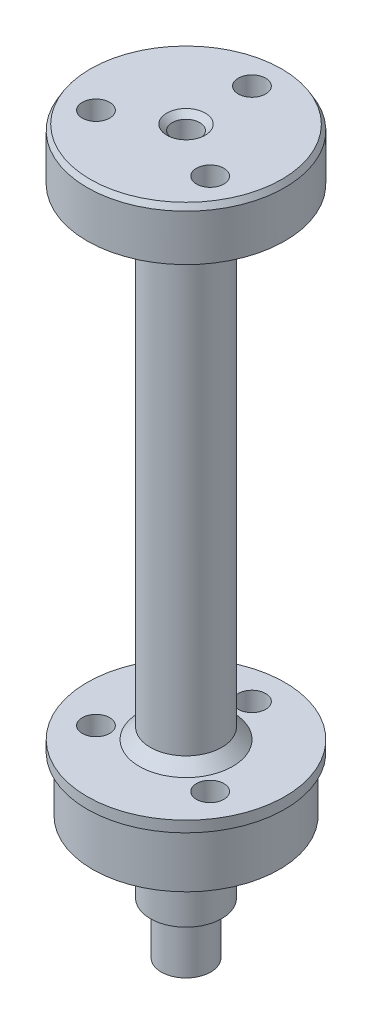
ISO-10303-21;
HEADER;
FILE_DESCRIPTION(('STEP AP214'),'2;1');
FILE_NAME('part.step','',(''),(''),'','','');
FILE_SCHEMA(('AUTOMOTIVE_DESIGN { 1 0 10303 214 1 1 1 1 }'));
ENDSEC;
DATA;
#1=APPLICATION_CONTEXT('core data for automotive mechanical design processes');
#2=APPLICATION_PROTOCOL_DEFINITION('international standard','automotive_design',2000,#1);
#3=PRODUCT_CONTEXT('',#1,'mechanical');
#4=PRODUCT('Part','Part','',(#3));
#5=PRODUCT_RELATED_PRODUCT_CATEGORY('part','',(#4));
#6=PRODUCT_DEFINITION_FORMATION('','',#4);
#7=PRODUCT_DEFINITION_CONTEXT('part definition',#1,'design');
#8=PRODUCT_DEFINITION('design','',#6,#7);
#9=PRODUCT_DEFINITION_SHAPE('','',#8);
#10=(LENGTH_UNIT() NAMED_UNIT(*) SI_UNIT(.MILLI.,.METRE.));
#11=(NAMED_UNIT(*) PLANE_ANGLE_UNIT() SI_UNIT($,.RADIAN.));
#12=(NAMED_UNIT(*) SI_UNIT($,.STERADIAN.) SOLID_ANGLE_UNIT());
#13=UNCERTAINTY_MEASURE_WITH_UNIT(LENGTH_MEASURE(1.E-05),#10,'distance_accuracy_value','');
#14=(GEOMETRIC_REPRESENTATION_CONTEXT(3) GLOBAL_UNCERTAINTY_ASSIGNED_CONTEXT((#13)) GLOBAL_UNIT_ASSIGNED_CONTEXT((#10,
#11,#12)) REPRESENTATION_CONTEXT('',''));
#15=CARTESIAN_POINT('',(0.,0.,0.));
#16=DIRECTION('',(0.,0.,1.));
#17=DIRECTION('',(1.,0.,0.));
#18=AXIS2_PLACEMENT_3D('',#15,#16,#17);
#19=CARTESIAN_POINT('',(9.00000000000001,54.5,0.));
#20=DIRECTION('',(0.,-1.,0.));
#21=DIRECTION('',(0.,0.,-1.));
#22=AXIS2_PLACEMENT_3D('',#19,#20,#21);
#23=PLANE('',#22);
#24=CARTESIAN_POINT('',(-5.19615242270664,54.5,3.));
#25=DIRECTION('',(0.,1.,0.));
#26=DIRECTION('',(0.,0.,1.));
#27=AXIS2_PLACEMENT_3D('',#24,#25,#26);
#28=CIRCLE('',#27,1.24999999999999);
#29=CARTESIAN_POINT('',(-5.19615242270664,54.5,4.24999999999999));
#30=VERTEX_POINT('',#29);
#31=EDGE_CURVE('E94',#30,#30,#28,.T.);
#32=ORIENTED_EDGE('',*,*,#31,.F.);
#33=EDGE_LOOP('',(#32));
#34=FACE_BOUND('',#33,.T.);
#35=CARTESIAN_POINT('',(5.19615242270664,54.5,3.));
#36=DIRECTION('',(0.,1.,0.));
#37=DIRECTION('',(0.,0.,1.));
#38=AXIS2_PLACEMENT_3D('',#35,#36,#37);
#39=CIRCLE('',#38,1.24999999999999);
#40=CARTESIAN_POINT('',(5.19615242270664,54.5,4.24999999999999));
#41=VERTEX_POINT('',#40);
#42=EDGE_CURVE('E89',#41,#41,#39,.T.);
#43=ORIENTED_EDGE('',*,*,#42,.F.);
#44=EDGE_LOOP('',(#43));
#45=FACE_BOUND('',#44,.T.);
#46=CARTESIAN_POINT('',(0.,54.5,-6.00000000000001));
#47=DIRECTION('',(0.,1.,0.));
#48=DIRECTION('',(0.,0.,1.));
#49=AXIS2_PLACEMENT_3D('',#46,#47,#48);
#50=CIRCLE('',#49,1.24999999999999);
#51=CARTESIAN_POINT('',(0.,54.5,-4.75000000000003));
#52=VERTEX_POINT('',#51);
#53=EDGE_CURVE('E84',#52,#52,#50,.T.);
#54=ORIENTED_EDGE('',*,*,#53,.F.);
#55=EDGE_LOOP('',(#54));
#56=FACE_BOUND('',#55,.T.);
#57=CARTESIAN_POINT('',(0.,54.5,0.));
#58=DIRECTION('',(0.,-1.,0.));
#59=DIRECTION('',(0.,0.,-1.));
#60=AXIS2_PLACEMENT_3D('',#57,#58,#59);
#61=CIRCLE('',#60,8.71132486540521);
#62=CARTESIAN_POINT('',(0.,54.5,-8.71132486540521));
#63=VERTEX_POINT('',#62);
#64=EDGE_CURVE('E10',#63,#63,#61,.F.);
#65=ORIENTED_EDGE('',*,*,#64,.T.);
#66=EDGE_LOOP('',(#65));
#67=FACE_BOUND('',#66,.T.);
#68=CARTESIAN_POINT('',(0.,54.5,0.));
#69=DIRECTION('',(0.,1.,0.));
#70=DIRECTION('',(0.,0.,1.));
#71=AXIS2_PLACEMENT_3D('',#68,#69,#70);
#72=CIRCLE('',#71,1.75);
#73=CARTESIAN_POINT('',(0.,54.5,1.75));
#74=VERTEX_POINT('',#73);
#75=EDGE_CURVE('E142',#74,#74,#72,.T.);
#76=ORIENTED_EDGE('',*,*,#75,.F.);
#77=EDGE_LOOP('',(#76));
#78=FACE_BOUND('',#77,.T.);
#79=ADVANCED_FACE('F40',(#34,#45,#56,#67,#78),#23,.F.);
#80=CARTESIAN_POINT('',(0.,60.,0.));
#81=DIRECTION('',(0.,1.,0.));
#82=DIRECTION('',(0.,0.,1.));
#83=AXIS2_PLACEMENT_3D('',#80,#81,#82);
#84=CYLINDRICAL_SURFACE('',#83,3.25);
#85=CARTESIAN_POINT('',(0.,0.,0.));
#86=DIRECTION('',(0.,1.,0.));
#87=DIRECTION('',(0.,0.,1.));
#88=AXIS2_PLACEMENT_3D('',#85,#86,#87);
#89=CIRCLE('',#88,3.25);
#90=CARTESIAN_POINT('',(0.,0.,3.25));
#91=VERTEX_POINT('',#90);
#92=EDGE_CURVE('E115',#91,#91,#89,.T.);
#93=ORIENTED_EDGE('',*,*,#92,.F.);
#94=EDGE_LOOP('',(#93));
#95=FACE_BOUND('',#94,.T.);
#96=CARTESIAN_POINT('',(0.,-6.50000000000001,0.));
#97=DIRECTION('',(0.,1.,0.));
#98=DIRECTION('',(0.,0.,1.));
#99=AXIS2_PLACEMENT_3D('',#96,#97,#98);
#100=CIRCLE('',#99,3.25);
#101=CARTESIAN_POINT('',(0.,-6.50000000000001,3.25));
#102=VERTEX_POINT('',#101);
#103=EDGE_CURVE('E79',#102,#102,#100,.T.);
#104=ORIENTED_EDGE('',*,*,#103,.T.);
#105=EDGE_LOOP('',(#104));
#106=FACE_BOUND('',#105,.T.);
#107=ADVANCED_FACE('F149',(#95,#106),#84,.T.);
#108=CARTESIAN_POINT('',(3.25,-6.5,0.));
#109=DIRECTION('',(0.,1.,0.));
#110=DIRECTION('',(0.,0.,1.));
#111=AXIS2_PLACEMENT_3D('',#108,#109,#110);
#112=PLANE('',#111);
#113=ORIENTED_EDGE('',*,*,#103,.F.);
#114=EDGE_LOOP('',(#113));
#115=FACE_BOUND('',#114,.T.);
#116=CARTESIAN_POINT('',(0.,-6.50000000000001,0.));
#117=DIRECTION('',(0.,1.,0.));
#118=DIRECTION('',(0.,0.,1.));
#119=AXIS2_PLACEMENT_3D('',#116,#117,#118);
#120=CIRCLE('',#119,2.25000000000001);
#121=CARTESIAN_POINT('',(0.,-6.50000000000001,2.25000000000001));
#122=VERTEX_POINT('',#121);
#123=EDGE_CURVE('E97',#122,#122,#120,.T.);
#124=ORIENTED_EDGE('',*,*,#123,.T.);
#125=EDGE_LOOP('',(#124));
#126=FACE_BOUND('',#125,.T.);
#127=ADVANCED_FACE('F155',(#115,#126),#112,.F.);
#128=CARTESIAN_POINT('',(0.,60.,0.));
#129=DIRECTION('',(0.,1.,0.));
#130=DIRECTION('',(0.,0.,1.));
#131=AXIS2_PLACEMENT_3D('',#128,#129,#130);
#132=CYLINDRICAL_SURFACE('',#131,2.25000000000001);
#133=CARTESIAN_POINT('',(0.,-11.2113248654052,0.));
#134=DIRECTION('',(0.,1.,0.));
#135=DIRECTION('',(0.,0.,1.));
#136=AXIS2_PLACEMENT_3D('',#133,#134,#135);
#137=CIRCLE('',#136,2.25000000000001);
#138=CARTESIAN_POINT('',(0.,-11.2113248654052,2.25000000000001));
#139=VERTEX_POINT('',#138);
#140=EDGE_CURVE('E64',#139,#139,#137,.T.);
#141=ORIENTED_EDGE('',*,*,#140,.T.);
#142=EDGE_LOOP('',(#141));
#143=FACE_BOUND('',#142,.T.);
#144=ORIENTED_EDGE('',*,*,#123,.F.);
#145=EDGE_LOOP('',(#144));
#146=FACE_BOUND('',#145,.T.);
#147=ADVANCED_FACE('F171',(#143,#146),#132,.T.);
#148=CARTESIAN_POINT('',(2.25000000000001,-11.5,0.));
#149=DIRECTION('',(0.,1.,0.));
#150=DIRECTION('',(0.,0.,1.));
#151=AXIS2_PLACEMENT_3D('',#148,#149,#150);
#152=PLANE('',#151);
#153=CARTESIAN_POINT('',(0.,-11.5,0.));
#154=DIRECTION('',(0.,1.,0.));
#155=DIRECTION('',(0.,0.,1.));
#156=AXIS2_PLACEMENT_3D('',#153,#154,#155);
#157=CIRCLE('',#156,1.74999999999999);
#158=CARTESIAN_POINT('',(0.,-11.5,1.74999999999999));
#159=VERTEX_POINT('',#158);
#160=EDGE_CURVE('E61',#159,#159,#157,.F.);
#161=ORIENTED_EDGE('',*,*,#160,.T.);
#162=EDGE_LOOP('',(#161));
#163=FACE_BOUND('',#162,.T.);
#164=CARTESIAN_POINT('',(0.,-11.5,0.));
#165=DIRECTION('',(0.,1.,0.));
#166=DIRECTION('',(0.,0.,1.));
#167=AXIS2_PLACEMENT_3D('',#164,#165,#166);
#168=CIRCLE('',#167,1.25000000000001);
#169=CARTESIAN_POINT('',(0.,-11.5,1.25000000000001));
#170=VERTEX_POINT('',#169);
#171=EDGE_CURVE('E100',#170,#170,#168,.T.);
#172=ORIENTED_EDGE('',*,*,#171,.T.);
#173=EDGE_LOOP('',(#172));
#174=FACE_BOUND('',#173,.T.);
#175=ADVANCED_FACE('F167',(#163,#174),#152,.F.);
#176=CARTESIAN_POINT('',(0.,60.,0.));
#177=DIRECTION('',(0.,1.,0.));
#178=DIRECTION('',(0.,0.,1.));
#179=AXIS2_PLACEMENT_3D('',#176,#177,#178);
#180=CYLINDRICAL_SURFACE('',#179,1.25000000000001);
#181=ORIENTED_EDGE('',*,*,#171,.F.);
#182=EDGE_LOOP('',(#181));
#183=FACE_BOUND('',#182,.T.);
#184=CARTESIAN_POINT('',(0.,54.,0.));
#185=DIRECTION('',(0.,1.,0.));
#186=DIRECTION('',(0.,0.,1.));
#187=AXIS2_PLACEMENT_3D('',#184,#185,#186);
#188=CIRCLE('',#187,1.25);
#189=CARTESIAN_POINT('',(0.,54.,1.25));
#190=VERTEX_POINT('',#189);
#191=EDGE_CURVE('E139',#190,#190,#188,.T.);
#192=ORIENTED_EDGE('',*,*,#191,.T.);
#193=EDGE_LOOP('',(#192));
#194=FACE_BOUND('',#193,.T.);
#195=ADVANCED_FACE('F164',(#183,#194),#180,.F.);
#196=CARTESIAN_POINT('',(0.,60.,0.));
#197=DIRECTION('',(0.,1.,0.));
#198=DIRECTION('',(0.,0.,1.));
#199=AXIS2_PLACEMENT_3D('',#196,#197,#198);
#200=CYLINDRICAL_SURFACE('',#199,9.00000000000001);
#201=CARTESIAN_POINT('',(0.,49.7886751345948,0.));
#202=DIRECTION('',(0.,1.,0.));
#203=DIRECTION('',(0.,0.,1.));
#204=AXIS2_PLACEMENT_3D('',#201,#202,#203);
#205=CIRCLE('',#204,9.00000000000001);
#206=CARTESIAN_POINT('',(0.,49.7886751345948,9.00000000000001));
#207=VERTEX_POINT('',#206);
#208=EDGE_CURVE('E52',#207,#207,#205,.T.);
#209=ORIENTED_EDGE('',*,*,#208,.T.);
#210=EDGE_LOOP('',(#209));
#211=FACE_BOUND('',#210,.T.);
#212=CARTESIAN_POINT('',(0.,54.,0.));
#213=DIRECTION('',(0.,-1.,0.));
#214=DIRECTION('',(0.,0.,-1.));
#215=AXIS2_PLACEMENT_3D('',#212,#213,#214);
#216=CIRCLE('',#215,9.00000000000001);
#217=CARTESIAN_POINT('',(0.,54.,-9.00000000000001));
#218=VERTEX_POINT('',#217);
#219=EDGE_CURVE('E56',#218,#218,#216,.T.);
#220=ORIENTED_EDGE('',*,*,#219,.T.);
#221=EDGE_LOOP('',(#220));
#222=FACE_BOUND('',#221,.T.);
#223=ADVANCED_FACE('F162',(#211,#222),#200,.T.);
#224=CARTESIAN_POINT('',(9.00000000000001,49.5,0.));
#225=DIRECTION('',(0.,1.,0.));
#226=DIRECTION('',(0.,0.,1.));
#227=AXIS2_PLACEMENT_3D('',#224,#225,#226);
#228=PLANE('',#227);
#229=CARTESIAN_POINT('',(0.,49.5,0.));
#230=DIRECTION('',(0.,1.,0.));
#231=DIRECTION('',(0.,0.,1.));
#232=AXIS2_PLACEMENT_3D('',#229,#230,#231);
#233=CIRCLE('',#232,8.50000000000003);
#234=CARTESIAN_POINT('',(0.,49.5,8.50000000000003));
#235=VERTEX_POINT('',#234);
#236=EDGE_CURVE('E48',#235,#235,#233,.F.);
#237=ORIENTED_EDGE('',*,*,#236,.T.);
#238=EDGE_LOOP('',(#237));
#239=FACE_BOUND('',#238,.T.);
#240=CARTESIAN_POINT('',(0.,49.5,0.));
#241=DIRECTION('',(0.,1.,0.));
#242=DIRECTION('',(0.,0.,1.));
#243=AXIS2_PLACEMENT_3D('',#240,#241,#242);
#244=CIRCLE('',#243,4.25);
#245=CARTESIAN_POINT('',(0.,49.5,4.25));
#246=VERTEX_POINT('',#245);
#247=EDGE_CURVE('E67',#246,#246,#244,.T.);
#248=ORIENTED_EDGE('',*,*,#247,.T.);
#249=EDGE_LOOP('',(#248));
#250=FACE_BOUND('',#249,.T.);
#251=CARTESIAN_POINT('',(0.,49.5,-6.00000000000001));
#252=DIRECTION('',(0.,1.,0.));
#253=DIRECTION('',(0.,0.,1.));
#254=AXIS2_PLACEMENT_3D('',#251,#252,#253);
#255=CIRCLE('',#254,1.24999999999999);
#256=CARTESIAN_POINT('',(0.,49.5,-4.75000000000003));
#257=VERTEX_POINT('',#256);
#258=EDGE_CURVE('E132',#257,#257,#255,.T.);
#259=ORIENTED_EDGE('',*,*,#258,.T.);
#260=EDGE_LOOP('',(#259));
#261=FACE_BOUND('',#260,.T.);
#262=CARTESIAN_POINT('',(5.19615242270664,49.5,3.));
#263=DIRECTION('',(0.,1.,0.));
#264=DIRECTION('',(0.,0.,1.));
#265=AXIS2_PLACEMENT_3D('',#262,#263,#264);
#266=CIRCLE('',#265,1.24999999999999);
#267=CARTESIAN_POINT('',(5.19615242270664,49.5,4.24999999999999));
#268=VERTEX_POINT('',#267);
#269=EDGE_CURVE('E125',#268,#268,#266,.T.);
#270=ORIENTED_EDGE('',*,*,#269,.T.);
#271=EDGE_LOOP('',(#270));
#272=FACE_BOUND('',#271,.T.);
#273=CARTESIAN_POINT('',(-5.19615242270664,49.5,3.));
#274=DIRECTION('',(0.,1.,0.));
#275=DIRECTION('',(0.,0.,1.));
#276=AXIS2_PLACEMENT_3D('',#273,#274,#275);
#277=CIRCLE('',#276,1.24999999999999);
#278=CARTESIAN_POINT('',(-5.19615242270664,49.5,4.24999999999999));
#279=VERTEX_POINT('',#278);
#280=EDGE_CURVE('E118',#279,#279,#277,.T.);
#281=ORIENTED_EDGE('',*,*,#280,.T.);
#282=EDGE_LOOP('',(#281));
#283=FACE_BOUND('',#282,.T.);
#284=ADVANCED_FACE('F209',(#239,#250,#261,#272,#283),#228,.F.);
#285=CARTESIAN_POINT('',(0.,60.,0.));
#286=DIRECTION('',(0.,1.,0.));
#287=DIRECTION('',(0.,0.,1.));
#288=AXIS2_PLACEMENT_3D('',#285,#286,#287);
#289=CYLINDRICAL_SURFACE('',#288,3.24999999999999);
#290=CARTESIAN_POINT('',(0.,7.00000000000001,0.));
#291=DIRECTION('',(0.,-1.,0.));
#292=DIRECTION('',(0.,0.,-1.));
#293=AXIS2_PLACEMENT_3D('',#290,#291,#292);
#294=CIRCLE('',#293,3.24999999999999);
#295=CARTESIAN_POINT('',(0.,7.00000000000001,-3.24999999999999));
#296=VERTEX_POINT('',#295);
#297=EDGE_CURVE('E73',#296,#296,#294,.F.);
#298=ORIENTED_EDGE('',*,*,#297,.T.);
#299=EDGE_LOOP('',(#298));
#300=FACE_BOUND('',#299,.T.);
#301=CARTESIAN_POINT('',(0.,48.5,0.));
#302=DIRECTION('',(0.,1.,0.));
#303=DIRECTION('',(0.,0.,1.));
#304=AXIS2_PLACEMENT_3D('',#301,#302,#303);
#305=CIRCLE('',#304,3.24999999999999);
#306=CARTESIAN_POINT('',(0.,48.5,3.24999999999999));
#307=VERTEX_POINT('',#306);
#308=EDGE_CURVE('E76',#307,#307,#305,.F.);
#309=ORIENTED_EDGE('',*,*,#308,.T.);
#310=EDGE_LOOP('',(#309));
#311=FACE_BOUND('',#310,.T.);
#312=ADVANCED_FACE('F215',(#300,#311),#289,.T.);
#313=CARTESIAN_POINT('',(9.00000000000002,6.,0.));
#314=DIRECTION('',(0.,-1.,0.));
#315=DIRECTION('',(0.,0.,-1.));
#316=AXIS2_PLACEMENT_3D('',#313,#314,#315);
#317=PLANE('',#316);
#318=CARTESIAN_POINT('',(0.,6.,0.));
#319=DIRECTION('',(0.,-1.,0.));
#320=DIRECTION('',(0.,0.,-1.));
#321=AXIS2_PLACEMENT_3D('',#318,#319,#320);
#322=CIRCLE('',#321,4.24999999999998);
#323=CARTESIAN_POINT('',(0.,6.,-4.24999999999998));
#324=VERTEX_POINT('',#323);
#325=EDGE_CURVE('E70',#324,#324,#322,.T.);
#326=ORIENTED_EDGE('',*,*,#325,.T.);
#327=EDGE_LOOP('',(#326));
#328=FACE_BOUND('',#327,.T.);
#329=CARTESIAN_POINT('',(0.,6.,-6.00000000000001));
#330=DIRECTION('',(0.,-1.,0.));
#331=DIRECTION('',(0.,0.,-1.));
#332=AXIS2_PLACEMENT_3D('',#329,#330,#331);
#333=CIRCLE('',#332,1.24999999999999);
#334=CARTESIAN_POINT('',(0.,6.,-7.25));
#335=VERTEX_POINT('',#334);
#336=EDGE_CURVE('E83',#335,#335,#333,.T.);
#337=ORIENTED_EDGE('',*,*,#336,.T.);
#338=EDGE_LOOP('',(#337));
#339=FACE_BOUND('',#338,.T.);
#340=CARTESIAN_POINT('',(5.19615242270664,6.,3.));
#341=DIRECTION('',(0.,-1.,0.));
#342=DIRECTION('',(0.,0.,-1.));
#343=AXIS2_PLACEMENT_3D('',#340,#341,#342);
#344=CIRCLE('',#343,1.24999999999999);
#345=CARTESIAN_POINT('',(5.19615242270664,6.,1.75000000000002));
#346=VERTEX_POINT('',#345);
#347=EDGE_CURVE('E88',#346,#346,#344,.T.);
#348=ORIENTED_EDGE('',*,*,#347,.T.);
#349=EDGE_LOOP('',(#348));
#350=FACE_BOUND('',#349,.T.);
#351=CARTESIAN_POINT('',(-5.19615242270664,6.,3.));
#352=DIRECTION('',(0.,-1.,0.));
#353=DIRECTION('',(0.,0.,-1.));
#354=AXIS2_PLACEMENT_3D('',#351,#352,#353);
#355=CIRCLE('',#354,1.24999999999999);
#356=CARTESIAN_POINT('',(-5.19615242270664,6.,1.75000000000002));
#357=VERTEX_POINT('',#356);
#358=EDGE_CURVE('E93',#357,#357,#355,.T.);
#359=ORIENTED_EDGE('',*,*,#358,.T.);
#360=EDGE_LOOP('',(#359));
#361=FACE_BOUND('',#360,.T.);
#362=CARTESIAN_POINT('',(0.,6.,0.));
#363=DIRECTION('',(0.,1.,0.));
#364=DIRECTION('',(0.,0.,1.));
#365=AXIS2_PLACEMENT_3D('',#362,#363,#364);
#366=CIRCLE('',#365,9.00000000000002);
#367=CARTESIAN_POINT('',(0.,6.,9.00000000000002));
#368=VERTEX_POINT('',#367);
#369=EDGE_CURVE('E103',#368,#368,#366,.T.);
#370=ORIENTED_EDGE('',*,*,#369,.T.);
#371=EDGE_LOOP('',(#370));
#372=FACE_BOUND('',#371,.T.);
#373=ADVANCED_FACE('F219',(#328,#339,#350,#361,#372),#317,.F.);
#374=CARTESIAN_POINT('',(0.,60.,0.));
#375=DIRECTION('',(0.,1.,0.));
#376=DIRECTION('',(0.,0.,1.));
#377=AXIS2_PLACEMENT_3D('',#374,#375,#376);
#378=CYLINDRICAL_SURFACE('',#377,9.00000000000001);
#379=ORIENTED_EDGE('',*,*,#369,.F.);
#380=EDGE_LOOP('',(#379));
#381=FACE_BOUND('',#380,.T.);
#382=CARTESIAN_POINT('',(0.,5.,0.));
#383=DIRECTION('',(0.,1.,0.));
#384=DIRECTION('',(0.,0.,1.));
#385=AXIS2_PLACEMENT_3D('',#382,#383,#384);
#386=CIRCLE('',#385,9.00000000000001);
#387=CARTESIAN_POINT('',(0.,5.,9.00000000000001));
#388=VERTEX_POINT('',#387);
#389=EDGE_CURVE('E106',#388,#388,#386,.T.);
#390=ORIENTED_EDGE('',*,*,#389,.T.);
#391=EDGE_LOOP('',(#390));
#392=FACE_BOUND('',#391,.T.);
#393=ADVANCED_FACE('F226',(#381,#392),#378,.T.);
#394=CARTESIAN_POINT('',(8.50000000000001,5.,0.));
#395=DIRECTION('',(0.,1.,0.));
#396=DIRECTION('',(0.,0.,1.));
#397=AXIS2_PLACEMENT_3D('',#394,#395,#396);
#398=PLANE('',#397);
#399=ORIENTED_EDGE('',*,*,#389,.F.);
#400=EDGE_LOOP('',(#399));
#401=FACE_BOUND('',#400,.T.);
#402=CARTESIAN_POINT('',(0.,5.,0.));
#403=DIRECTION('',(0.,1.,0.));
#404=DIRECTION('',(0.,0.,1.));
#405=AXIS2_PLACEMENT_3D('',#402,#403,#404);
#406=CIRCLE('',#405,8.50000000000001);
#407=CARTESIAN_POINT('',(0.,5.,8.50000000000001));
#408=VERTEX_POINT('',#407);
#409=EDGE_CURVE('E109',#408,#408,#406,.T.);
#410=ORIENTED_EDGE('',*,*,#409,.T.);
#411=EDGE_LOOP('',(#410));
#412=FACE_BOUND('',#411,.T.);
#413=ADVANCED_FACE('F230',(#401,#412),#398,.F.);
#414=CARTESIAN_POINT('',(0.,60.,0.));
#415=DIRECTION('',(0.,1.,0.));
#416=DIRECTION('',(0.,0.,1.));
#417=AXIS2_PLACEMENT_3D('',#414,#415,#416);
#418=CYLINDRICAL_SURFACE('',#417,8.50000000000001);
#419=ORIENTED_EDGE('',*,*,#409,.F.);
#420=EDGE_LOOP('',(#419));
#421=FACE_BOUND('',#420,.T.);
#422=CARTESIAN_POINT('',(0.,0.,0.));
#423=DIRECTION('',(0.,1.,0.));
#424=DIRECTION('',(0.,0.,1.));
#425=AXIS2_PLACEMENT_3D('',#422,#423,#424);
#426=CIRCLE('',#425,8.50000000000001);
#427=CARTESIAN_POINT('',(0.,0.,8.50000000000001));
#428=VERTEX_POINT('',#427);
#429=EDGE_CURVE('E112',#428,#428,#426,.T.);
#430=ORIENTED_EDGE('',*,*,#429,.T.);
#431=EDGE_LOOP('',(#430));
#432=FACE_BOUND('',#431,.T.);
#433=ADVANCED_FACE('F234',(#421,#432),#418,.T.);
#434=CARTESIAN_POINT('',(3.25,0.,0.));
#435=DIRECTION('',(0.,1.,0.));
#436=DIRECTION('',(0.,0.,1.));
#437=AXIS2_PLACEMENT_3D('',#434,#435,#436);
#438=PLANE('',#437);
#439=CARTESIAN_POINT('',(0.,0.,-6.00000000000001));
#440=DIRECTION('',(0.,1.,0.));
#441=DIRECTION('',(0.,0.,1.));
#442=AXIS2_PLACEMENT_3D('',#439,#440,#441);
#443=CIRCLE('',#442,1.24999999999999);
#444=CARTESIAN_POINT('',(0.,0.,-4.75000000000003));
#445=VERTEX_POINT('',#444);
#446=EDGE_CURVE('E80',#445,#445,#443,.T.);
#447=ORIENTED_EDGE('',*,*,#446,.T.);
#448=EDGE_LOOP('',(#447));
#449=FACE_BOUND('',#448,.T.);
#450=CARTESIAN_POINT('',(5.19615242270664,0.,3.));
#451=DIRECTION('',(0.,1.,0.));
#452=DIRECTION('',(0.,0.,1.));
#453=AXIS2_PLACEMENT_3D('',#450,#451,#452);
#454=CIRCLE('',#453,1.24999999999999);
#455=CARTESIAN_POINT('',(5.19615242270664,0.,4.24999999999999));
#456=VERTEX_POINT('',#455);
#457=EDGE_CURVE('E85',#456,#456,#454,.T.);
#458=ORIENTED_EDGE('',*,*,#457,.T.);
#459=EDGE_LOOP('',(#458));
#460=FACE_BOUND('',#459,.T.);
#461=CARTESIAN_POINT('',(-5.19615242270664,0.,3.));
#462=DIRECTION('',(0.,1.,0.));
#463=DIRECTION('',(0.,0.,1.));
#464=AXIS2_PLACEMENT_3D('',#461,#462,#463);
#465=CIRCLE('',#464,1.24999999999999);
#466=CARTESIAN_POINT('',(-5.19615242270664,0.,4.24999999999999));
#467=VERTEX_POINT('',#466);
#468=EDGE_CURVE('E90',#467,#467,#465,.T.);
#469=ORIENTED_EDGE('',*,*,#468,.T.);
#470=EDGE_LOOP('',(#469));
#471=FACE_BOUND('',#470,.T.);
#472=ORIENTED_EDGE('',*,*,#429,.F.);
#473=EDGE_LOOP('',(#472));
#474=FACE_BOUND('',#473,.T.);
#475=ORIENTED_EDGE('',*,*,#92,.T.);
#476=EDGE_LOOP('',(#475));
#477=FACE_BOUND('',#476,.T.);
#478=ADVANCED_FACE('F238',(#449,#460,#471,#474,#477),#438,.F.);
#479=CARTESIAN_POINT('',(-5.19615242270664,54.5,3.));
#480=DIRECTION('',(0.,1.,0.));
#481=DIRECTION('',(0.,0.,1.));
#482=AXIS2_PLACEMENT_3D('',#479,#480,#481);
#483=CYLINDRICAL_SURFACE('',#482,1.24999999999999);
#484=ORIENTED_EDGE('',*,*,#468,.F.);
#485=EDGE_LOOP('',(#484));
#486=FACE_BOUND('',#485,.T.);
#487=ORIENTED_EDGE('',*,*,#358,.F.);
#488=EDGE_LOOP('',(#487));
#489=FACE_BOUND('',#488,.T.);
#490=ADVANCED_FACE('F242',(#486,#489),#483,.F.);
#491=ORIENTED_EDGE('',*,*,#31,.T.);
#492=EDGE_LOOP('',(#491));
#493=FACE_BOUND('',#492,.T.);
#494=ORIENTED_EDGE('',*,*,#280,.F.);
#495=EDGE_LOOP('',(#494));
#496=FACE_BOUND('',#495,.T.);
#497=ADVANCED_FACE('F244',(#493,#496),#483,.F.);
#498=CARTESIAN_POINT('',(5.19615242270664,54.5,3.));
#499=DIRECTION('',(0.,1.,0.));
#500=DIRECTION('',(0.,0.,1.));
#501=AXIS2_PLACEMENT_3D('',#498,#499,#500);
#502=CYLINDRICAL_SURFACE('',#501,1.24999999999999);
#503=ORIENTED_EDGE('',*,*,#457,.F.);
#504=EDGE_LOOP('',(#503));
#505=FACE_BOUND('',#504,.T.);
#506=ORIENTED_EDGE('',*,*,#347,.F.);
#507=EDGE_LOOP('',(#506));
#508=FACE_BOUND('',#507,.T.);
#509=ADVANCED_FACE('F247',(#505,#508),#502,.F.);
#510=ORIENTED_EDGE('',*,*,#42,.T.);
#511=EDGE_LOOP('',(#510));
#512=FACE_BOUND('',#511,.T.);
#513=ORIENTED_EDGE('',*,*,#269,.F.);
#514=EDGE_LOOP('',(#513));
#515=FACE_BOUND('',#514,.T.);
#516=ADVANCED_FACE('F249',(#512,#515),#502,.F.);
#517=CARTESIAN_POINT('',(0.,54.5,-6.00000000000001));
#518=DIRECTION('',(0.,1.,0.));
#519=DIRECTION('',(0.,0.,1.));
#520=AXIS2_PLACEMENT_3D('',#517,#518,#519);
#521=CYLINDRICAL_SURFACE('',#520,1.24999999999999);
#522=ORIENTED_EDGE('',*,*,#446,.F.);
#523=EDGE_LOOP('',(#522));
#524=FACE_BOUND('',#523,.T.);
#525=ORIENTED_EDGE('',*,*,#336,.F.);
#526=EDGE_LOOP('',(#525));
#527=FACE_BOUND('',#526,.T.);
#528=ADVANCED_FACE('F252',(#524,#527),#521,.F.);
#529=ORIENTED_EDGE('',*,*,#53,.T.);
#530=EDGE_LOOP('',(#529));
#531=FACE_BOUND('',#530,.T.);
#532=ORIENTED_EDGE('',*,*,#258,.F.);
#533=EDGE_LOOP('',(#532));
#534=FACE_BOUND('',#533,.T.);
#535=ADVANCED_FACE('F183',(#531,#534),#521,.F.);
#536=CARTESIAN_POINT('',(0.,7.00000000000001,0.));
#537=DIRECTION('',(0.,-1.,0.));
#538=DIRECTION('',(0.,0.,-1.));
#539=AXIS2_PLACEMENT_3D('',#536,#537,#538);
#540=CONICAL_SURFACE('',#539,3.24999999999999,0.785398163397442);
#541=ORIENTED_EDGE('',*,*,#325,.F.);
#542=EDGE_LOOP('',(#541));
#543=FACE_BOUND('',#542,.T.);
#544=ORIENTED_EDGE('',*,*,#297,.F.);
#545=EDGE_LOOP('',(#544));
#546=FACE_BOUND('',#545,.T.);
#547=ADVANCED_FACE('F179',(#543,#546),#540,.T.);
#548=CARTESIAN_POINT('',(0.,49.5,0.));
#549=DIRECTION('',(0.,1.,0.));
#550=DIRECTION('',(0.,0.,1.));
#551=AXIS2_PLACEMENT_3D('',#548,#549,#550);
#552=CONICAL_SURFACE('',#551,4.25,0.785398163397452);
#553=ORIENTED_EDGE('',*,*,#308,.F.);
#554=EDGE_LOOP('',(#553));
#555=FACE_BOUND('',#554,.T.);
#556=ORIENTED_EDGE('',*,*,#247,.F.);
#557=EDGE_LOOP('',(#556));
#558=FACE_BOUND('',#557,.T.);
#559=ADVANCED_FACE('F182',(#555,#558),#552,.T.);
#560=CARTESIAN_POINT('',(0.,-11.2113248654052,0.));
#561=DIRECTION('',(0.,1.,0.));
#562=DIRECTION('',(0.,0.,1.));
#563=AXIS2_PLACEMENT_3D('',#560,#561,#562);
#564=CONICAL_SURFACE('',#563,2.25000000000001,1.04719755119661);
#565=ORIENTED_EDGE('',*,*,#160,.F.);
#566=EDGE_LOOP('',(#565));
#567=FACE_BOUND('',#566,.T.);
#568=ORIENTED_EDGE('',*,*,#140,.F.);
#569=EDGE_LOOP('',(#568));
#570=FACE_BOUND('',#569,.T.);
#571=ADVANCED_FACE('F187',(#567,#570),#564,.T.);
#572=CARTESIAN_POINT('',(0.,49.7886751345948,0.));
#573=DIRECTION('',(0.,1.,0.));
#574=DIRECTION('',(0.,0.,1.));
#575=AXIS2_PLACEMENT_3D('',#572,#573,#574);
#576=CONICAL_SURFACE('',#575,9.00000000000001,1.04719755119659);
#577=ORIENTED_EDGE('',*,*,#236,.F.);
#578=EDGE_LOOP('',(#577));
#579=FACE_BOUND('',#578,.T.);
#580=ORIENTED_EDGE('',*,*,#208,.F.);
#581=EDGE_LOOP('',(#580));
#582=FACE_BOUND('',#581,.T.);
#583=ADVANCED_FACE('F194',(#579,#582),#576,.T.);
#584=CARTESIAN_POINT('',(0.,54.5,0.));
#585=DIRECTION('',(0.,-1.,0.));
#586=DIRECTION('',(0.,0.,-1.));
#587=AXIS2_PLACEMENT_3D('',#584,#585,#586);
#588=CONICAL_SURFACE('',#587,8.71132486540521,0.523598775598293);
#589=ORIENTED_EDGE('',*,*,#219,.F.);
#590=EDGE_LOOP('',(#589));
#591=FACE_BOUND('',#590,.T.);
#592=ORIENTED_EDGE('',*,*,#64,.F.);
#593=EDGE_LOOP('',(#592));
#594=FACE_BOUND('',#593,.T.);
#595=ADVANCED_FACE('F43',(#591,#594),#588,.T.);
#596=CARTESIAN_POINT('',(0.,54.5,0.));
#597=DIRECTION('',(0.,1.,0.));
#598=DIRECTION('',(0.,0.,1.));
#599=AXIS2_PLACEMENT_3D('',#596,#597,#598);
#600=CONICAL_SURFACE('',#599,1.75,0.785398163397449);
#601=ORIENTED_EDGE('',*,*,#191,.F.);
#602=EDGE_LOOP('',(#601));
#603=FACE_BOUND('',#602,.T.);
#604=ORIENTED_EDGE('',*,*,#75,.T.);
#605=EDGE_LOOP('',(#604));
#606=FACE_BOUND('',#605,.T.);
#607=ADVANCED_FACE('F146',(#603,#606),#600,.F.);
#608=CLOSED_SHELL('',(#79,#107,#127,#147,#175,#195,#223,#284,#312,#373,#393,#413,#433,#478,#490,
#497,#509,#516,#528,#535,#547,#559,#571,#583,#595,#607));
#609=MANIFOLD_SOLID_BREP('B2',#608);
#610=ADVANCED_BREP_SHAPE_REPRESENTATION('',(#18,#609),#14);
#611=SHAPE_DEFINITION_REPRESENTATION(#9,#610);
ENDSEC;
END-ISO-10303-21;
